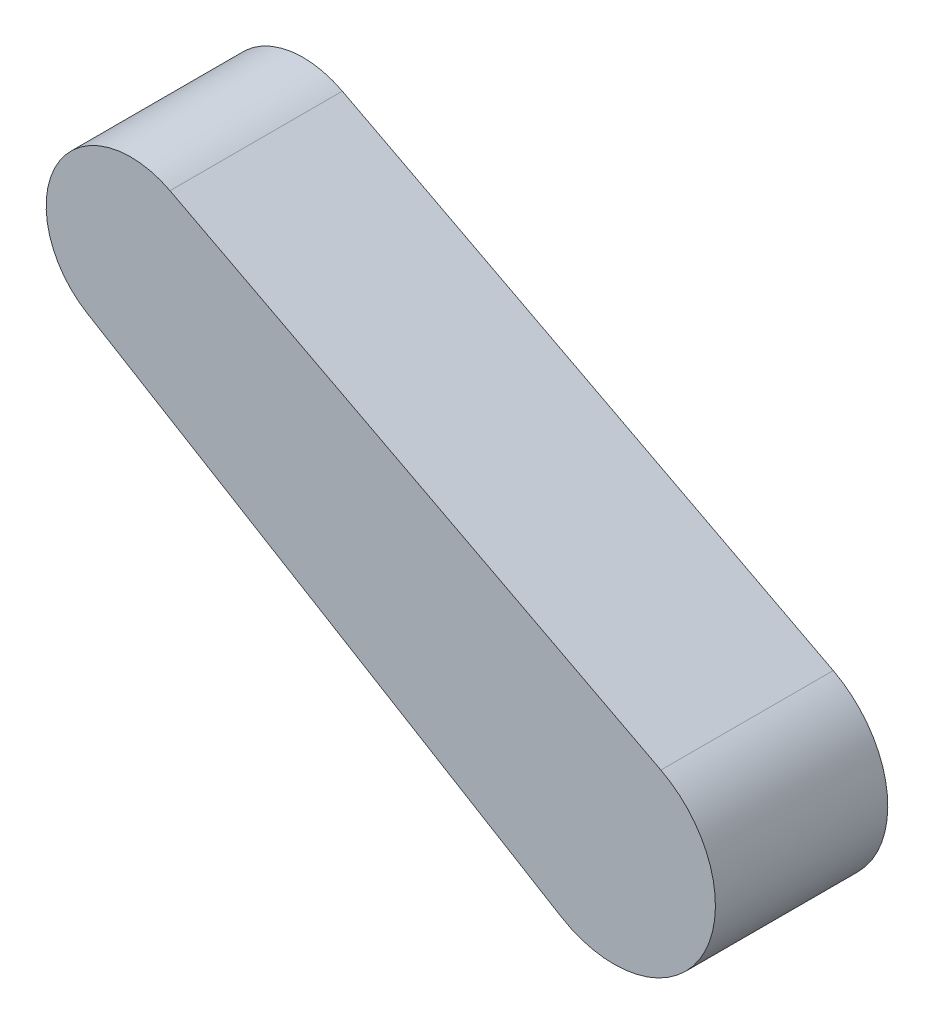
ISO-10303-21;
HEADER;
FILE_DESCRIPTION(('STEP AP214'),'2;1');
FILE_NAME('part.step','',(''),(''),'','','');
FILE_SCHEMA(('AUTOMOTIVE_DESIGN { 1 0 10303 214 1 1 1 1 }'));
ENDSEC;
DATA;
#1=APPLICATION_CONTEXT('core data for automotive mechanical design processes');
#2=APPLICATION_PROTOCOL_DEFINITION('international standard','automotive_design',2000,#1);
#3=PRODUCT_CONTEXT('',#1,'mechanical');
#4=PRODUCT('Part','Part','',(#3));
#5=PRODUCT_RELATED_PRODUCT_CATEGORY('part','',(#4));
#6=PRODUCT_DEFINITION_FORMATION('','',#4);
#7=PRODUCT_DEFINITION_CONTEXT('part definition',#1,'design');
#8=PRODUCT_DEFINITION('design','',#6,#7);
#9=PRODUCT_DEFINITION_SHAPE('','',#8);
#10=(LENGTH_UNIT() NAMED_UNIT(*) SI_UNIT(.MILLI.,.METRE.));
#11=(NAMED_UNIT(*) PLANE_ANGLE_UNIT() SI_UNIT($,.RADIAN.));
#12=(NAMED_UNIT(*) SI_UNIT($,.STERADIAN.) SOLID_ANGLE_UNIT());
#13=UNCERTAINTY_MEASURE_WITH_UNIT(LENGTH_MEASURE(1.E-05),#10,'distance_accuracy_value','');
#14=(GEOMETRIC_REPRESENTATION_CONTEXT(3) GLOBAL_UNCERTAINTY_ASSIGNED_CONTEXT((#13)) GLOBAL_UNIT_ASSIGNED_CONTEXT((#10,
#11,#12)) REPRESENTATION_CONTEXT('',''));
#15=CARTESIAN_POINT('',(0.,0.,0.));
#16=DIRECTION('',(0.,0.,1.));
#17=DIRECTION('',(1.,0.,0.));
#18=AXIS2_PLACEMENT_3D('',#15,#16,#17);
#19=CARTESIAN_POINT('',(-95.2317317679497,-182.378820444885,-142.24));
#20=DIRECTION('',(-0.462862309878004,-0.886430190197964,0.));
#21=DIRECTION('',(0.886430190197964,-0.462862309878004,0.));
#22=AXIS2_PLACEMENT_3D('',#19,#20,#21);
#23=PLANE('',#22);
#24=DIRECTION('',(0.886430190197964,-0.462862309878004,0.));
#25=VECTOR('',#24,1.);
#26=CARTESIAN_POINT('',(-95.2317317679497,-182.378820444885,0.));
#27=LINE('',#26,#25);
#28=CARTESIAN_POINT('',(-1475.25917452724,538.222414614523,0.));
#29=VERTEX_POINT('',#28);
#30=CARTESIAN_POINT('',(-1070.17252703654,326.700578567393,0.));
#31=VERTEX_POINT('',#30);
#32=EDGE_CURVE('E101',#29,#31,#27,.T.);
#33=ORIENTED_EDGE('',*,*,#32,.T.);
#34=DIRECTION('',(0.,0.,1.));
#35=VECTOR('',#34,1.);
#36=CARTESIAN_POINT('',(-1070.17252703654,326.700578567393,-142.24));
#37=LINE('',#36,#35);
#38=CARTESIAN_POINT('',(-1070.17252703654,326.700578567393,-142.24));
#39=VERTEX_POINT('',#38);
#40=EDGE_CURVE('E11',#39,#31,#37,.T.);
#41=ORIENTED_EDGE('',*,*,#40,.F.);
#42=DIRECTION('',(0.886430190197964,-0.462862309878004,0.));
#43=VECTOR('',#42,1.);
#44=CARTESIAN_POINT('',(-95.2317317679497,-182.378820444885,-142.24));
#45=LINE('',#44,#43);
#46=CARTESIAN_POINT('',(-1475.25917452724,538.222414614523,-142.24));
#47=VERTEX_POINT('',#46);
#48=EDGE_CURVE('E96',#47,#39,#45,.T.);
#49=ORIENTED_EDGE('',*,*,#48,.F.);
#50=DIRECTION('',(0.,0.,1.));
#51=VECTOR('',#50,1.);
#52=CARTESIAN_POINT('',(-1475.25917452724,538.222414614523,-142.24));
#53=LINE('',#52,#51);
#54=EDGE_CURVE('E40',#47,#29,#53,.T.);
#55=ORIENTED_EDGE('',*,*,#54,.T.);
#56=EDGE_LOOP('',(#33,#41,#49,#55));
#57=FACE_BOUND('',#56,.T.);
#58=ADVANCED_FACE('F37',(#57),#23,.F.);
#59=CARTESIAN_POINT('',(-1108.96964585052,252.400000025,-142.24));
#60=DIRECTION('',(0.,0.,1.));
#61=DIRECTION('',(1.,0.,0.));
#62=AXIS2_PLACEMENT_3D('',#59,#60,#61);
#63=CYLINDRICAL_SURFACE('',#62,83.8199999999999);
#64=CARTESIAN_POINT('',(-1108.96964585052,252.400000025,0.));
#65=DIRECTION('',(0.,0.,1.));
#66=DIRECTION('',(1.,0.,0.));
#67=AXIS2_PLACEMENT_3D('',#64,#65,#66);
#68=CIRCLE('',#67,83.8199999999999);
#69=CARTESIAN_POINT('',(-1152.23279020001,180.607989738376,0.));
#70=VERTEX_POINT('',#69);
#71=EDGE_CURVE('E76',#31,#70,#68,.F.);
#72=ORIENTED_EDGE('',*,*,#71,.T.);
#73=DIRECTION('',(0.,0.,1.));
#74=VECTOR('',#73,1.);
#75=CARTESIAN_POINT('',(-1152.23279020001,180.607989738376,-142.24));
#76=LINE('',#75,#74);
#77=CARTESIAN_POINT('',(-1152.23279020001,180.607989738376,-142.24));
#78=VERTEX_POINT('',#77);
#79=EDGE_CURVE('E46',#78,#70,#76,.T.);
#80=ORIENTED_EDGE('',*,*,#79,.F.);
#81=CARTESIAN_POINT('',(-1108.96964585052,252.400000025,-142.24));
#82=DIRECTION('',(0.,0.,1.));
#83=DIRECTION('',(1.,0.,0.));
#84=AXIS2_PLACEMENT_3D('',#81,#82,#83);
#85=CIRCLE('',#84,83.8199999999999);
#86=EDGE_CURVE('E54',#39,#78,#85,.F.);
#87=ORIENTED_EDGE('',*,*,#86,.F.);
#88=ORIENTED_EDGE('',*,*,#40,.T.);
#89=EDGE_LOOP('',(#72,#80,#87,#88));
#90=FACE_BOUND('',#89,.T.);
#91=ADVANCED_FACE('F108',(#90),#63,.T.);
#92=CARTESIAN_POINT('',(-227.116684686848,-376.883456079457,-142.24));
#93=DIRECTION('',(-0.516143454420129,-0.85650215087836,0.));
#94=DIRECTION('',(0.85650215087836,-0.516143454420129,0.));
#95=AXIS2_PLACEMENT_3D('',#92,#93,#94);
#96=PLANE('',#95);
#97=DIRECTION('',(0.85650215087836,-0.516143454420129,0.));
#98=VECTOR('',#97,1.);
#99=CARTESIAN_POINT('',(-227.116684686848,-376.883456079457,0.));
#100=LINE('',#99,#98);
#101=CARTESIAN_POINT('',(-1543.64272716346,416.478590590342,0.));
#102=VERTEX_POINT('',#101);
#103=EDGE_CURVE('E88',#102,#70,#100,.T.);
#104=ORIENTED_EDGE('',*,*,#103,.F.);
#105=DIRECTION('',(0.,0.,1.));
#106=VECTOR('',#105,1.);
#107=CARTESIAN_POINT('',(-1543.64272716346,416.478590590342,-142.24));
#108=LINE('',#107,#106);
#109=CARTESIAN_POINT('',(-1543.64272716346,416.478590590342,-142.24));
#110=VERTEX_POINT('',#109);
#111=EDGE_CURVE('E84',#110,#102,#108,.T.);
#112=ORIENTED_EDGE('',*,*,#111,.F.);
#113=DIRECTION('',(0.85650215087836,-0.516143454420129,0.));
#114=VECTOR('',#113,1.);
#115=CARTESIAN_POINT('',(-227.116684686848,-376.883456079457,-142.24));
#116=LINE('',#115,#114);
#117=EDGE_CURVE('E87',#110,#78,#116,.T.);
#118=ORIENTED_EDGE('',*,*,#117,.T.);
#119=ORIENTED_EDGE('',*,*,#79,.T.);
#120=EDGE_LOOP('',(#104,#112,#118,#119));
#121=FACE_BOUND('',#120,.T.);
#122=ADVANCED_FACE('F86',(#121),#96,.T.);
#123=CARTESIAN_POINT('',(-1507.59010687222,476.305265829196,-142.24));
#124=DIRECTION('',(0.,0.,1.));
#125=DIRECTION('',(1.,0.,0.));
#126=AXIS2_PLACEMENT_3D('',#123,#124,#125);
#127=CYLINDRICAL_SURFACE('',#126,69.8499999999999);
#128=CARTESIAN_POINT('',(-1507.59010687222,476.305265829196,0.));
#129=DIRECTION('',(0.,0.,1.));
#130=DIRECTION('',(1.,0.,0.));
#131=AXIS2_PLACEMENT_3D('',#128,#129,#130);
#132=CIRCLE('',#131,69.8499999999999);
#133=EDGE_CURVE('E104',#29,#102,#132,.T.);
#134=ORIENTED_EDGE('',*,*,#133,.F.);
#135=ORIENTED_EDGE('',*,*,#54,.F.);
#136=CARTESIAN_POINT('',(-1507.59010687222,476.305265829196,-142.24));
#137=DIRECTION('',(0.,0.,1.));
#138=DIRECTION('',(1.,0.,0.));
#139=AXIS2_PLACEMENT_3D('',#136,#137,#138);
#140=CIRCLE('',#139,69.8499999999999);
#141=EDGE_CURVE('E93',#47,#110,#140,.T.);
#142=ORIENTED_EDGE('',*,*,#141,.T.);
#143=ORIENTED_EDGE('',*,*,#111,.T.);
#144=EDGE_LOOP('',(#134,#135,#142,#143));
#145=FACE_BOUND('',#144,.T.);
#146=ADVANCED_FACE('F95',(#145),#127,.T.);
#147=CARTESIAN_POINT('',(0.,0.,-142.24));
#148=DIRECTION('',(0.,0.,1.));
#149=DIRECTION('',(1.,0.,0.));
#150=AXIS2_PLACEMENT_3D('',#147,#148,#149);
#151=PLANE('',#150);
#152=ORIENTED_EDGE('',*,*,#48,.T.);
#153=ORIENTED_EDGE('',*,*,#86,.T.);
#154=ORIENTED_EDGE('',*,*,#117,.F.);
#155=ORIENTED_EDGE('',*,*,#141,.F.);
#156=EDGE_LOOP('',(#152,#153,#154,#155));
#157=FACE_BOUND('',#156,.T.);
#158=ADVANCED_FACE('F92',(#157),#151,.F.);
#159=CARTESIAN_POINT('',(0.,0.,0.));
#160=DIRECTION('',(0.,0.,1.));
#161=DIRECTION('',(1.,0.,0.));
#162=AXIS2_PLACEMENT_3D('',#159,#160,#161);
#163=PLANE('',#162);
#164=ORIENTED_EDGE('',*,*,#32,.F.);
#165=ORIENTED_EDGE('',*,*,#133,.T.);
#166=ORIENTED_EDGE('',*,*,#103,.T.);
#167=ORIENTED_EDGE('',*,*,#71,.F.);
#168=EDGE_LOOP('',(#164,#165,#166,#167));
#169=FACE_BOUND('',#168,.T.);
#170=ADVANCED_FACE('F110',(#169),#163,.T.);
#171=CLOSED_SHELL('',(#58,#91,#122,#146,#158,#170));
#172=MANIFOLD_SOLID_BREP('B2',#171);
#173=ADVANCED_BREP_SHAPE_REPRESENTATION('',(#18,#172),#14);
#174=SHAPE_DEFINITION_REPRESENTATION(#9,#173);
ENDSEC;
END-ISO-10303-21;
